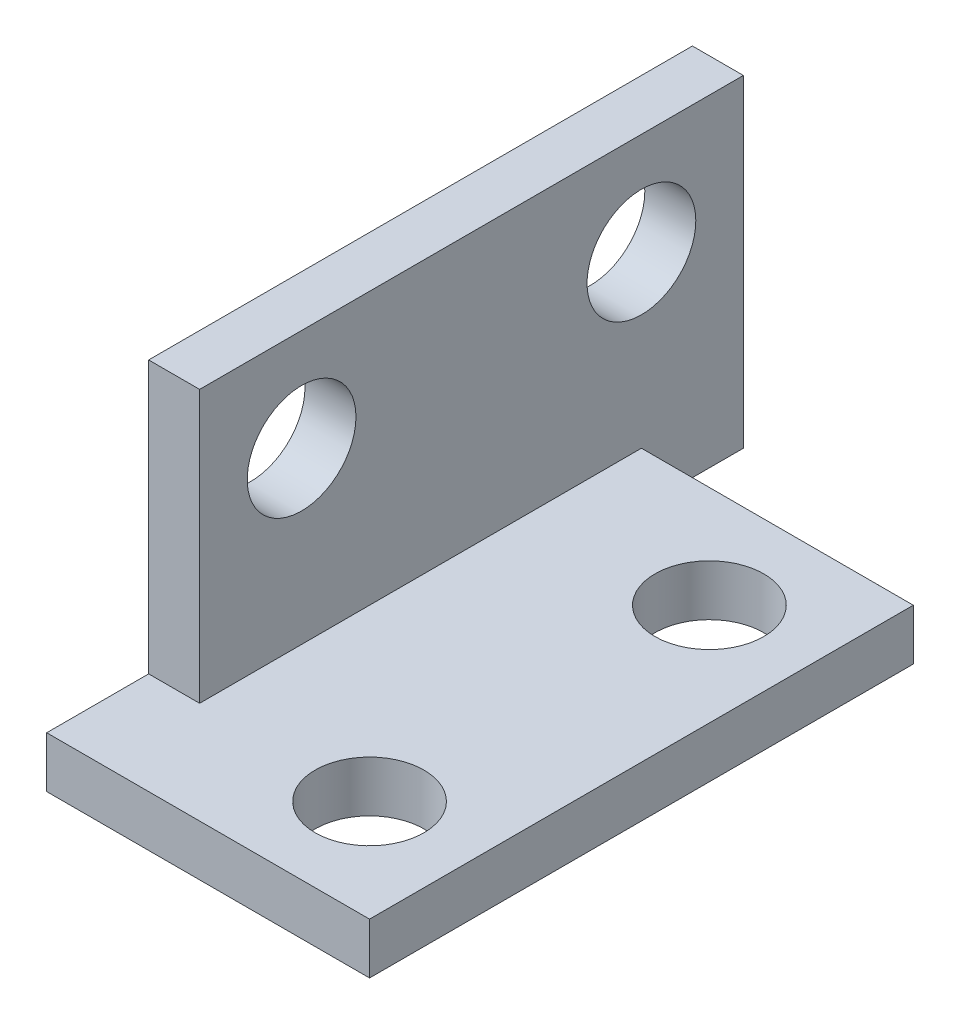
ISO-10303-21;
HEADER;
FILE_DESCRIPTION(('STEP AP214'),'2;1');
FILE_NAME('part.step','',(''),(''),'','','');
FILE_SCHEMA(('AUTOMOTIVE_DESIGN { 1 0 10303 214 1 1 1 1 }'));
ENDSEC;
DATA;
#1=APPLICATION_CONTEXT('core data for automotive mechanical design processes');
#2=APPLICATION_PROTOCOL_DEFINITION('international standard','automotive_design',2000,#1);
#3=PRODUCT_CONTEXT('',#1,'mechanical');
#4=PRODUCT('Part','Part','',(#3));
#5=PRODUCT_RELATED_PRODUCT_CATEGORY('part','',(#4));
#6=PRODUCT_DEFINITION_FORMATION('','',#4);
#7=PRODUCT_DEFINITION_CONTEXT('part definition',#1,'design');
#8=PRODUCT_DEFINITION('design','',#6,#7);
#9=PRODUCT_DEFINITION_SHAPE('','',#8);
#10=(LENGTH_UNIT() NAMED_UNIT(*) SI_UNIT(.MILLI.,.METRE.));
#11=(NAMED_UNIT(*) PLANE_ANGLE_UNIT() SI_UNIT($,.RADIAN.));
#12=(NAMED_UNIT(*) SI_UNIT($,.STERADIAN.) SOLID_ANGLE_UNIT());
#13=UNCERTAINTY_MEASURE_WITH_UNIT(LENGTH_MEASURE(1.E-05),#10,'distance_accuracy_value','');
#14=(GEOMETRIC_REPRESENTATION_CONTEXT(3) GLOBAL_UNCERTAINTY_ASSIGNED_CONTEXT((#13)) GLOBAL_UNIT_ASSIGNED_CONTEXT((#10,
#11,#12)) REPRESENTATION_CONTEXT('',''));
#15=CARTESIAN_POINT('',(0.,0.,0.));
#16=DIRECTION('',(0.,0.,1.));
#17=DIRECTION('',(1.,0.,0.));
#18=AXIS2_PLACEMENT_3D('',#15,#16,#17);
#19=CARTESIAN_POINT('',(0.,1.5,0.));
#20=DIRECTION('',(0.,-1.,0.));
#21=DIRECTION('',(0.,0.,-1.));
#22=AXIS2_PLACEMENT_3D('',#19,#20,#21);
#23=PLANE('',#22);
#24=CARTESIAN_POINT('',(13.,1.5,0.));
#25=DIRECTION('',(0.,-1.,0.));
#26=DIRECTION('',(0.,0.,1.));
#27=AXIS2_PLACEMENT_3D('',#24,#25,#26);
#28=CIRCLE('',#27,1.6);
#29=CARTESIAN_POINT('',(13.,1.5,1.6));
#30=VERTEX_POINT('',#29);
#31=EDGE_CURVE('E137',#30,#30,#28,.T.);
#32=ORIENTED_EDGE('',*,*,#31,.T.);
#33=EDGE_LOOP('',(#32));
#34=FACE_BOUND('',#33,.T.);
#35=CARTESIAN_POINT('',(13.,1.5,10.));
#36=DIRECTION('',(0.,-1.,0.));
#37=DIRECTION('',(0.,0.,1.));
#38=AXIS2_PLACEMENT_3D('',#35,#36,#37);
#39=CIRCLE('',#38,1.6);
#40=CARTESIAN_POINT('',(13.,1.5,11.6));
#41=VERTEX_POINT('',#40);
#42=EDGE_CURVE('E131',#41,#41,#39,.T.);
#43=ORIENTED_EDGE('',*,*,#42,.T.);
#44=EDGE_LOOP('',(#43));
#45=FACE_BOUND('',#44,.T.);
#46=DIRECTION('',(1.,0.,0.));
#47=VECTOR('',#46,1.);
#48=CARTESIAN_POINT('',(-13.8531324370476,1.5,10.));
#49=LINE('',#48,#47);
#50=CARTESIAN_POINT('',(6.5,1.5,10.));
#51=VERTEX_POINT('',#50);
#52=CARTESIAN_POINT('',(8.,1.5,10.));
#53=VERTEX_POINT('',#52);
#54=EDGE_CURVE('E157',#51,#53,#49,.T.);
#55=ORIENTED_EDGE('',*,*,#54,.F.);
#56=DIRECTION('',(0.,0.,1.));
#57=VECTOR('',#56,1.);
#58=CARTESIAN_POINT('',(6.5,1.5,13.));
#59=LINE('',#58,#57);
#60=CARTESIAN_POINT('',(6.49999999999999,1.5,13.));
#61=VERTEX_POINT('',#60);
#62=EDGE_CURVE('E42',#51,#61,#59,.T.);
#63=ORIENTED_EDGE('',*,*,#62,.T.);
#64=DIRECTION('',(1.,0.,0.));
#65=VECTOR('',#64,1.);
#66=CARTESIAN_POINT('',(-3.,1.5,13.));
#67=LINE('',#66,#65);
#68=CARTESIAN_POINT('',(16.,1.5,13.));
#69=VERTEX_POINT('',#68);
#70=EDGE_CURVE('E150',#61,#69,#67,.T.);
#71=ORIENTED_EDGE('',*,*,#70,.T.);
#72=DIRECTION('',(0.,0.,1.));
#73=VECTOR('',#72,1.);
#74=CARTESIAN_POINT('',(16.,1.5,-8.));
#75=LINE('',#74,#73);
#76=CARTESIAN_POINT('',(16.,1.5,-3.));
#77=VERTEX_POINT('',#76);
#78=EDGE_CURVE('E143',#77,#69,#75,.T.);
#79=ORIENTED_EDGE('',*,*,#78,.F.);
#80=DIRECTION('',(1.,0.,0.));
#81=VECTOR('',#80,1.);
#82=CARTESIAN_POINT('',(16.,1.5,-3.));
#83=LINE('',#82,#81);
#84=CARTESIAN_POINT('',(8.,1.5,-3.));
#85=VERTEX_POINT('',#84);
#86=EDGE_CURVE('E170',#85,#77,#83,.T.);
#87=ORIENTED_EDGE('',*,*,#86,.F.);
#88=DIRECTION('',(0.,0.,1.));
#89=VECTOR('',#88,1.);
#90=CARTESIAN_POINT('',(8.,1.5,-8.));
#91=LINE('',#90,#89);
#92=EDGE_CURVE('E57',#85,#53,#91,.T.);
#93=ORIENTED_EDGE('',*,*,#92,.T.);
#94=EDGE_LOOP('',(#55,#63,#71,#79,#87,#93));
#95=FACE_BOUND('',#94,.T.);
#96=ADVANCED_FACE('F34',(#34,#45,#95),#23,.F.);
#97=CARTESIAN_POINT('',(0.,0.,0.));
#98=DIRECTION('',(0.,-1.,0.));
#99=DIRECTION('',(0.,0.,-1.));
#100=AXIS2_PLACEMENT_3D('',#97,#98,#99);
#101=PLANE('',#100);
#102=DIRECTION('',(1.,0.,0.));
#103=VECTOR('',#102,1.);
#104=CARTESIAN_POINT('',(6.5,0.,-6.));
#105=LINE('',#104,#103);
#106=CARTESIAN_POINT('',(6.5,0.,-6.));
#107=VERTEX_POINT('',#106);
#108=CARTESIAN_POINT('',(8.,0.,-6.));
#109=VERTEX_POINT('',#108);
#110=EDGE_CURVE('E49',#107,#109,#105,.T.);
#111=ORIENTED_EDGE('',*,*,#110,.T.);
#112=DIRECTION('',(0.,0.,-1.));
#113=VECTOR('',#112,1.);
#114=CARTESIAN_POINT('',(8.,0.,0.));
#115=LINE('',#114,#113);
#116=CARTESIAN_POINT('',(8.,0.,-3.));
#117=VERTEX_POINT('',#116);
#118=EDGE_CURVE('E162',#117,#109,#115,.T.);
#119=ORIENTED_EDGE('',*,*,#118,.F.);
#120=DIRECTION('',(-1.,0.,0.));
#121=VECTOR('',#120,1.);
#122=CARTESIAN_POINT('',(0.,0.,-3.));
#123=LINE('',#122,#121);
#124=CARTESIAN_POINT('',(16.,0.,-3.));
#125=VERTEX_POINT('',#124);
#126=EDGE_CURVE('E203',#125,#117,#123,.T.);
#127=ORIENTED_EDGE('',*,*,#126,.F.);
#128=DIRECTION('',(0.,0.,1.));
#129=VECTOR('',#128,1.);
#130=CARTESIAN_POINT('',(16.,0.,-8.));
#131=LINE('',#130,#129);
#132=CARTESIAN_POINT('',(16.,0.,13.));
#133=VERTEX_POINT('',#132);
#134=EDGE_CURVE('E140',#125,#133,#131,.T.);
#135=ORIENTED_EDGE('',*,*,#134,.T.);
#136=DIRECTION('',(1.,0.,0.));
#137=VECTOR('',#136,1.);
#138=CARTESIAN_POINT('',(6.5,0.,13.));
#139=LINE('',#138,#137);
#140=CARTESIAN_POINT('',(6.5,0.,13.));
#141=VERTEX_POINT('',#140);
#142=EDGE_CURVE('E149',#141,#133,#139,.T.);
#143=ORIENTED_EDGE('',*,*,#142,.F.);
#144=DIRECTION('',(0.,0.,-1.));
#145=VECTOR('',#144,1.);
#146=CARTESIAN_POINT('',(6.5,0.,0.));
#147=LINE('',#146,#145);
#148=EDGE_CURVE('E124',#141,#107,#147,.T.);
#149=ORIENTED_EDGE('',*,*,#148,.T.);
#150=EDGE_LOOP('',(#111,#119,#127,#135,#143,#149));
#151=FACE_BOUND('',#150,.T.);
#152=CARTESIAN_POINT('',(13.,0.,0.));
#153=DIRECTION('',(0.,-1.,0.));
#154=DIRECTION('',(0.,0.,1.));
#155=AXIS2_PLACEMENT_3D('',#152,#153,#154);
#156=CIRCLE('',#155,1.6);
#157=CARTESIAN_POINT('',(13.,0.,1.6));
#158=VERTEX_POINT('',#157);
#159=EDGE_CURVE('E134',#158,#158,#156,.T.);
#160=ORIENTED_EDGE('',*,*,#159,.F.);
#161=EDGE_LOOP('',(#160));
#162=FACE_BOUND('',#161,.T.);
#163=CARTESIAN_POINT('',(13.,0.,10.));
#164=DIRECTION('',(0.,-1.,0.));
#165=DIRECTION('',(0.,0.,1.));
#166=AXIS2_PLACEMENT_3D('',#163,#164,#165);
#167=CIRCLE('',#166,1.6);
#168=CARTESIAN_POINT('',(13.,0.,11.6));
#169=VERTEX_POINT('',#168);
#170=EDGE_CURVE('E130',#169,#169,#167,.T.);
#171=ORIENTED_EDGE('',*,*,#170,.F.);
#172=EDGE_LOOP('',(#171));
#173=FACE_BOUND('',#172,.T.);
#174=ADVANCED_FACE('F163',(#151,#162,#173),#101,.T.);
#175=CARTESIAN_POINT('',(6.5,1.5,13.));
#176=DIRECTION('',(0.,0.,-1.));
#177=DIRECTION('',(-1.,0.,0.));
#178=AXIS2_PLACEMENT_3D('',#175,#176,#177);
#179=PLANE('',#178);
#180=ORIENTED_EDGE('',*,*,#70,.F.);
#181=DIRECTION('',(0.,-1.,0.));
#182=VECTOR('',#181,1.);
#183=CARTESIAN_POINT('',(6.5,9.5,13.));
#184=LINE('',#183,#182);
#185=EDGE_CURVE('E122',#61,#141,#184,.T.);
#186=ORIENTED_EDGE('',*,*,#185,.T.);
#187=ORIENTED_EDGE('',*,*,#142,.T.);
#188=DIRECTION('',(0.,-1.,0.));
#189=VECTOR('',#188,1.);
#190=CARTESIAN_POINT('',(16.,1.5,13.));
#191=LINE('',#190,#189);
#192=EDGE_CURVE('E145',#69,#133,#191,.T.);
#193=ORIENTED_EDGE('',*,*,#192,.F.);
#194=EDGE_LOOP('',(#180,#186,#187,#193));
#195=FACE_BOUND('',#194,.T.);
#196=ADVANCED_FACE('F36',(#195),#179,.F.);
#197=CARTESIAN_POINT('',(0.,9.5,0.));
#198=DIRECTION('',(0.,1.,0.));
#199=DIRECTION('',(0.,0.,1.));
#200=AXIS2_PLACEMENT_3D('',#197,#198,#199);
#201=PLANE('',#200);
#202=DIRECTION('',(1.,0.,0.));
#203=VECTOR('',#202,1.);
#204=CARTESIAN_POINT('',(6.5,9.5,-6.));
#205=LINE('',#204,#203);
#206=CARTESIAN_POINT('',(6.5,9.5,-6.));
#207=VERTEX_POINT('',#206);
#208=CARTESIAN_POINT('',(8.,9.5,-6.));
#209=VERTEX_POINT('',#208);
#210=EDGE_CURVE('E100',#207,#209,#205,.T.);
#211=ORIENTED_EDGE('',*,*,#210,.F.);
#212=DIRECTION('',(0.,0.,-1.));
#213=VECTOR('',#212,1.);
#214=CARTESIAN_POINT('',(6.5,9.5,13.));
#215=LINE('',#214,#213);
#216=CARTESIAN_POINT('',(6.5,9.5,10.));
#217=VERTEX_POINT('',#216);
#218=EDGE_CURVE('E112',#217,#207,#215,.T.);
#219=ORIENTED_EDGE('',*,*,#218,.F.);
#220=DIRECTION('',(1.,0.,0.));
#221=VECTOR('',#220,1.);
#222=CARTESIAN_POINT('',(-13.8531324370476,9.5,10.));
#223=LINE('',#222,#221);
#224=CARTESIAN_POINT('',(8.,9.5,10.));
#225=VERTEX_POINT('',#224);
#226=EDGE_CURVE('E185',#217,#225,#223,.T.);
#227=ORIENTED_EDGE('',*,*,#226,.T.);
#228=DIRECTION('',(0.,0.,1.));
#229=VECTOR('',#228,1.);
#230=CARTESIAN_POINT('',(8.,9.5,-8.));
#231=LINE('',#230,#229);
#232=EDGE_CURVE('E114',#209,#225,#231,.T.);
#233=ORIENTED_EDGE('',*,*,#232,.F.);
#234=EDGE_LOOP('',(#211,#219,#227,#233));
#235=FACE_BOUND('',#234,.T.);
#236=ADVANCED_FACE('F110',(#235),#201,.T.);
#237=CARTESIAN_POINT('',(16.,1.5,-8.));
#238=DIRECTION('',(1.,0.,0.));
#239=DIRECTION('',(0.,0.,-1.));
#240=AXIS2_PLACEMENT_3D('',#237,#238,#239);
#241=PLANE('',#240);
#242=DIRECTION('',(0.,-1.,0.));
#243=VECTOR('',#242,1.);
#244=CARTESIAN_POINT('',(16.,1.5,-3.));
#245=LINE('',#244,#243);
#246=EDGE_CURVE('E11',#77,#125,#245,.T.);
#247=ORIENTED_EDGE('',*,*,#246,.F.);
#248=ORIENTED_EDGE('',*,*,#78,.T.);
#249=ORIENTED_EDGE('',*,*,#192,.T.);
#250=ORIENTED_EDGE('',*,*,#134,.F.);
#251=EDGE_LOOP('',(#247,#248,#249,#250));
#252=FACE_BOUND('',#251,.T.);
#253=ADVANCED_FACE('F169',(#252),#241,.T.);
#254=CARTESIAN_POINT('',(13.,1.5,0.));
#255=DIRECTION('',(0.,-1.,0.));
#256=DIRECTION('',(0.,0.,-1.));
#257=AXIS2_PLACEMENT_3D('',#254,#255,#256);
#258=CYLINDRICAL_SURFACE('',#257,1.6);
#259=ORIENTED_EDGE('',*,*,#31,.F.);
#260=EDGE_LOOP('',(#259));
#261=FACE_BOUND('',#260,.T.);
#262=ORIENTED_EDGE('',*,*,#159,.T.);
#263=EDGE_LOOP('',(#262));
#264=FACE_BOUND('',#263,.T.);
#265=ADVANCED_FACE('F231',(#261,#264),#258,.F.);
#266=CARTESIAN_POINT('',(13.,1.5,10.));
#267=DIRECTION('',(0.,-1.,0.));
#268=DIRECTION('',(0.,0.,-1.));
#269=AXIS2_PLACEMENT_3D('',#266,#267,#268);
#270=CYLINDRICAL_SURFACE('',#269,1.6);
#271=ORIENTED_EDGE('',*,*,#42,.F.);
#272=EDGE_LOOP('',(#271));
#273=FACE_BOUND('',#272,.T.);
#274=ORIENTED_EDGE('',*,*,#170,.T.);
#275=EDGE_LOOP('',(#274));
#276=FACE_BOUND('',#275,.T.);
#277=ADVANCED_FACE('F234',(#273,#276),#270,.F.);
#278=CARTESIAN_POINT('',(8.,9.5,-8.));
#279=DIRECTION('',(1.,0.,0.));
#280=DIRECTION('',(0.,0.,-1.));
#281=AXIS2_PLACEMENT_3D('',#278,#279,#280);
#282=PLANE('',#281);
#283=DIRECTION('',(0.,-1.,0.));
#284=VECTOR('',#283,1.);
#285=CARTESIAN_POINT('',(8.,9.5,-6.));
#286=LINE('',#285,#284);
#287=EDGE_CURVE('E106',#209,#109,#286,.T.);
#288=ORIENTED_EDGE('',*,*,#287,.F.);
#289=ORIENTED_EDGE('',*,*,#232,.T.);
#290=DIRECTION('',(0.,1.,0.));
#291=VECTOR('',#290,1.);
#292=CARTESIAN_POINT('',(8.,0.,10.));
#293=LINE('',#292,#291);
#294=EDGE_CURVE('E183',#53,#225,#293,.T.);
#295=ORIENTED_EDGE('',*,*,#294,.F.);
#296=ORIENTED_EDGE('',*,*,#92,.F.);
#297=DIRECTION('',(0.,1.,0.));
#298=VECTOR('',#297,1.);
#299=CARTESIAN_POINT('',(8.,-62.5,-3.));
#300=LINE('',#299,#298);
#301=EDGE_CURVE('E172',#117,#85,#300,.T.);
#302=ORIENTED_EDGE('',*,*,#301,.F.);
#303=ORIENTED_EDGE('',*,*,#118,.T.);
#304=EDGE_LOOP('',(#288,#289,#295,#296,#302,#303));
#305=FACE_BOUND('',#304,.T.);
#306=CARTESIAN_POINT('',(8.,6.5,7.));
#307=DIRECTION('',(1.,0.,0.));
#308=DIRECTION('',(0.,0.,-1.));
#309=AXIS2_PLACEMENT_3D('',#306,#307,#308);
#310=CIRCLE('',#309,1.6);
#311=CARTESIAN_POINT('',(8.,6.5,5.4));
#312=VERTEX_POINT('',#311);
#313=EDGE_CURVE('E195',#312,#312,#310,.T.);
#314=ORIENTED_EDGE('',*,*,#313,.F.);
#315=EDGE_LOOP('',(#314));
#316=FACE_BOUND('',#315,.T.);
#317=CARTESIAN_POINT('',(8.,6.5,-3.));
#318=DIRECTION('',(1.,0.,0.));
#319=DIRECTION('',(0.,0.,-1.));
#320=AXIS2_PLACEMENT_3D('',#317,#318,#319);
#321=CIRCLE('',#320,1.6);
#322=CARTESIAN_POINT('',(8.,6.5,-4.6));
#323=VERTEX_POINT('',#322);
#324=EDGE_CURVE('E190',#323,#323,#321,.T.);
#325=ORIENTED_EDGE('',*,*,#324,.F.);
#326=EDGE_LOOP('',(#325));
#327=FACE_BOUND('',#326,.T.);
#328=ADVANCED_FACE('F178',(#305,#316,#327),#282,.T.);
#329=CARTESIAN_POINT('',(6.5,9.5,13.));
#330=DIRECTION('',(-1.,0.,0.));
#331=DIRECTION('',(0.,0.,1.));
#332=AXIS2_PLACEMENT_3D('',#329,#330,#331);
#333=PLANE('',#332);
#334=DIRECTION('',(0.,-1.,0.));
#335=VECTOR('',#334,1.);
#336=CARTESIAN_POINT('',(6.5,9.5,-6.));
#337=LINE('',#336,#335);
#338=EDGE_CURVE('E97',#207,#107,#337,.T.);
#339=ORIENTED_EDGE('',*,*,#338,.T.);
#340=ORIENTED_EDGE('',*,*,#148,.F.);
#341=ORIENTED_EDGE('',*,*,#185,.F.);
#342=ORIENTED_EDGE('',*,*,#62,.F.);
#343=DIRECTION('',(0.,1.,0.));
#344=VECTOR('',#343,1.);
#345=CARTESIAN_POINT('',(6.5,0.,10.));
#346=LINE('',#345,#344);
#347=EDGE_CURVE('E120',#51,#217,#346,.T.);
#348=ORIENTED_EDGE('',*,*,#347,.T.);
#349=ORIENTED_EDGE('',*,*,#218,.T.);
#350=EDGE_LOOP('',(#339,#340,#341,#342,#348,#349));
#351=FACE_BOUND('',#350,.T.);
#352=CARTESIAN_POINT('',(6.5,6.5,7.));
#353=DIRECTION('',(1.,0.,0.));
#354=DIRECTION('',(0.,0.,-1.));
#355=AXIS2_PLACEMENT_3D('',#352,#353,#354);
#356=CIRCLE('',#355,1.6);
#357=CARTESIAN_POINT('',(6.5,6.5,5.4));
#358=VERTEX_POINT('',#357);
#359=EDGE_CURVE('E173',#358,#358,#356,.T.);
#360=ORIENTED_EDGE('',*,*,#359,.T.);
#361=EDGE_LOOP('',(#360));
#362=FACE_BOUND('',#361,.T.);
#363=CARTESIAN_POINT('',(6.5,6.5,-3.));
#364=DIRECTION('',(1.,0.,0.));
#365=DIRECTION('',(0.,0.,-1.));
#366=AXIS2_PLACEMENT_3D('',#363,#364,#365);
#367=CIRCLE('',#366,1.6);
#368=CARTESIAN_POINT('',(6.5,6.5,-4.6));
#369=VERTEX_POINT('',#368);
#370=EDGE_CURVE('E192',#369,#369,#367,.T.);
#371=ORIENTED_EDGE('',*,*,#370,.T.);
#372=EDGE_LOOP('',(#371));
#373=FACE_BOUND('',#372,.T.);
#374=ADVANCED_FACE('F117',(#351,#362,#373),#333,.T.);
#375=CARTESIAN_POINT('',(16.,-62.5,-3.));
#376=DIRECTION('',(0.,0.,1.));
#377=DIRECTION('',(1.,0.,0.));
#378=AXIS2_PLACEMENT_3D('',#375,#376,#377);
#379=PLANE('',#378);
#380=ORIENTED_EDGE('',*,*,#126,.T.);
#381=ORIENTED_EDGE('',*,*,#301,.T.);
#382=ORIENTED_EDGE('',*,*,#86,.T.);
#383=ORIENTED_EDGE('',*,*,#246,.T.);
#384=EDGE_LOOP('',(#380,#381,#382,#383));
#385=FACE_BOUND('',#384,.T.);
#386=ADVANCED_FACE('F206',(#385),#379,.F.);
#387=CARTESIAN_POINT('',(6.5,6.5,7.));
#388=DIRECTION('',(1.,0.,0.));
#389=DIRECTION('',(0.,0.,-1.));
#390=AXIS2_PLACEMENT_3D('',#387,#388,#389);
#391=CYLINDRICAL_SURFACE('',#390,1.6);
#392=ORIENTED_EDGE('',*,*,#313,.T.);
#393=EDGE_LOOP('',(#392));
#394=FACE_BOUND('',#393,.T.);
#395=ORIENTED_EDGE('',*,*,#359,.F.);
#396=EDGE_LOOP('',(#395));
#397=FACE_BOUND('',#396,.T.);
#398=ADVANCED_FACE('F208',(#394,#397),#391,.F.);
#399=CARTESIAN_POINT('',(6.5,6.5,-3.));
#400=DIRECTION('',(1.,0.,0.));
#401=DIRECTION('',(0.,0.,-1.));
#402=AXIS2_PLACEMENT_3D('',#399,#400,#401);
#403=CYLINDRICAL_SURFACE('',#402,1.6);
#404=ORIENTED_EDGE('',*,*,#324,.T.);
#405=EDGE_LOOP('',(#404));
#406=FACE_BOUND('',#405,.T.);
#407=ORIENTED_EDGE('',*,*,#370,.F.);
#408=EDGE_LOOP('',(#407));
#409=FACE_BOUND('',#408,.T.);
#410=ADVANCED_FACE('F214',(#406,#409),#403,.F.);
#411=CARTESIAN_POINT('',(-13.8531324370476,0.,10.));
#412=DIRECTION('',(0.,0.,-1.));
#413=DIRECTION('',(-1.,0.,0.));
#414=AXIS2_PLACEMENT_3D('',#411,#412,#413);
#415=PLANE('',#414);
#416=ORIENTED_EDGE('',*,*,#347,.F.);
#417=ORIENTED_EDGE('',*,*,#54,.T.);
#418=ORIENTED_EDGE('',*,*,#294,.T.);
#419=ORIENTED_EDGE('',*,*,#226,.F.);
#420=EDGE_LOOP('',(#416,#417,#418,#419));
#421=FACE_BOUND('',#420,.T.);
#422=ADVANCED_FACE('F258',(#421),#415,.F.);
#423=CARTESIAN_POINT('',(6.5,9.5,-6.));
#424=DIRECTION('',(0.,0.,1.));
#425=DIRECTION('',(1.,0.,0.));
#426=AXIS2_PLACEMENT_3D('',#423,#424,#425);
#427=PLANE('',#426);
#428=ORIENTED_EDGE('',*,*,#287,.T.);
#429=ORIENTED_EDGE('',*,*,#110,.F.);
#430=ORIENTED_EDGE('',*,*,#338,.F.);
#431=ORIENTED_EDGE('',*,*,#210,.T.);
#432=EDGE_LOOP('',(#428,#429,#430,#431));
#433=FACE_BOUND('',#432,.T.);
#434=ADVANCED_FACE('F99',(#433),#427,.F.);
#435=CLOSED_SHELL('',(#96,#174,#196,#236,#253,#265,#277,#328,#374,#386,#398,#410,#422,#434));
#436=MANIFOLD_SOLID_BREP('B2',#435);
#437=ADVANCED_BREP_SHAPE_REPRESENTATION('',(#18,#436),#14);
#438=SHAPE_DEFINITION_REPRESENTATION(#9,#437);
ENDSEC;
END-ISO-10303-21;
